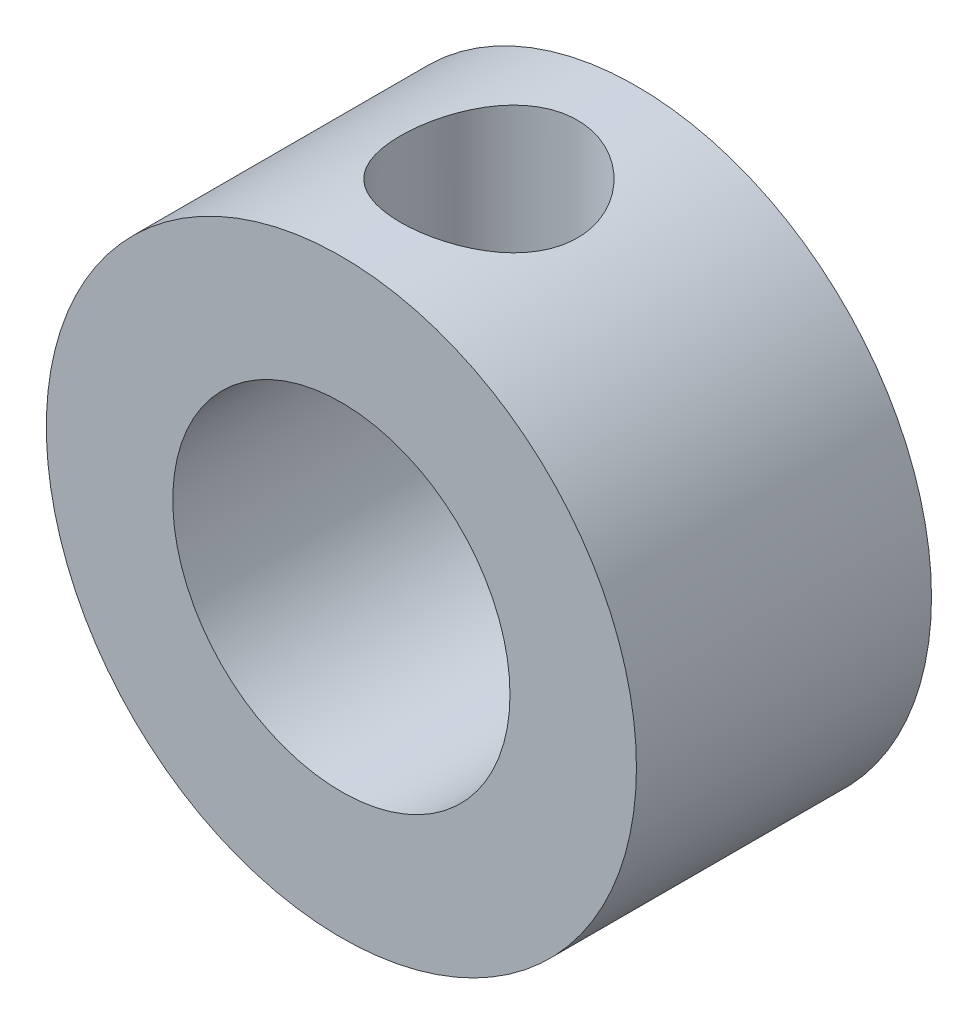
ISO-10303-21;
HEADER;
FILE_DESCRIPTION(('STEP AP214'),'2;1');
FILE_NAME('part.step','',(''),(''),'','','');
FILE_SCHEMA(('AUTOMOTIVE_DESIGN { 1 0 10303 214 1 1 1 1 }'));
ENDSEC;
DATA;
#1=APPLICATION_CONTEXT('core data for automotive mechanical design processes');
#2=APPLICATION_PROTOCOL_DEFINITION('international standard','automotive_design',2000,#1);
#3=PRODUCT_CONTEXT('',#1,'mechanical');
#4=PRODUCT('Part','Part','',(#3));
#5=PRODUCT_RELATED_PRODUCT_CATEGORY('part','',(#4));
#6=PRODUCT_DEFINITION_FORMATION('','',#4);
#7=PRODUCT_DEFINITION_CONTEXT('part definition',#1,'design');
#8=PRODUCT_DEFINITION('design','',#6,#7);
#9=PRODUCT_DEFINITION_SHAPE('','',#8);
#10=(LENGTH_UNIT() NAMED_UNIT(*) SI_UNIT(.MILLI.,.METRE.));
#11=(NAMED_UNIT(*) PLANE_ANGLE_UNIT() SI_UNIT($,.RADIAN.));
#12=(NAMED_UNIT(*) SI_UNIT($,.STERADIAN.) SOLID_ANGLE_UNIT());
#13=UNCERTAINTY_MEASURE_WITH_UNIT(LENGTH_MEASURE(1.E-05),#10,'distance_accuracy_value','');
#14=(GEOMETRIC_REPRESENTATION_CONTEXT(3) GLOBAL_UNCERTAINTY_ASSIGNED_CONTEXT((#13)) GLOBAL_UNIT_ASSIGNED_CONTEXT((#10,
#11,#12)) REPRESENTATION_CONTEXT('',''));
#15=CARTESIAN_POINT('',(0.,0.,0.));
#16=DIRECTION('',(0.,0.,1.));
#17=DIRECTION('',(1.,0.,0.));
#18=AXIS2_PLACEMENT_3D('',#15,#16,#17);
#19=CARTESIAN_POINT('',(0.,0.,7.));
#20=DIRECTION('',(0.,0.,1.));
#21=DIRECTION('',(1.,0.,0.));
#22=AXIS2_PLACEMENT_3D('',#19,#20,#21);
#23=PLANE('',#22);
#24=CARTESIAN_POINT('',(0.,0.,7.));
#25=DIRECTION('',(0.,0.,1.));
#26=DIRECTION('',(1.,0.,0.));
#27=AXIS2_PLACEMENT_3D('',#24,#25,#26);
#28=CIRCLE('',#27,7.);
#29=CARTESIAN_POINT('',(7.,0.,7.));
#30=VERTEX_POINT('',#29);
#31=EDGE_CURVE('E10',#30,#30,#28,.T.);
#32=ORIENTED_EDGE('',*,*,#31,.T.);
#33=EDGE_LOOP('',(#32));
#34=FACE_BOUND('',#33,.T.);
#35=CARTESIAN_POINT('',(0.,0.,7.));
#36=DIRECTION('',(0.,0.,1.));
#37=DIRECTION('',(1.,0.,0.));
#38=AXIS2_PLACEMENT_3D('',#35,#36,#37);
#39=CIRCLE('',#38,4.);
#40=CARTESIAN_POINT('',(4.,0.,7.));
#41=VERTEX_POINT('',#40);
#42=EDGE_CURVE('E47',#41,#41,#39,.T.);
#43=ORIENTED_EDGE('',*,*,#42,.F.);
#44=EDGE_LOOP('',(#43));
#45=FACE_BOUND('',#44,.T.);
#46=ADVANCED_FACE('F35',(#34,#45),#23,.T.);
#47=CARTESIAN_POINT('',(0.,0.,0.));
#48=DIRECTION('',(0.,0.,1.));
#49=DIRECTION('',(1.,0.,0.));
#50=AXIS2_PLACEMENT_3D('',#47,#48,#49);
#51=PLANE('',#50);
#52=CARTESIAN_POINT('',(0.,0.,0.));
#53=DIRECTION('',(0.,0.,1.));
#54=DIRECTION('',(1.,0.,0.));
#55=AXIS2_PLACEMENT_3D('',#52,#53,#54);
#56=CIRCLE('',#55,7.);
#57=CARTESIAN_POINT('',(7.,0.,0.));
#58=VERTEX_POINT('',#57);
#59=EDGE_CURVE('E40',#58,#58,#56,.T.);
#60=ORIENTED_EDGE('',*,*,#59,.F.);
#61=EDGE_LOOP('',(#60));
#62=FACE_BOUND('',#61,.T.);
#63=CARTESIAN_POINT('',(0.,0.,0.));
#64=DIRECTION('',(0.,0.,1.));
#65=DIRECTION('',(1.,0.,0.));
#66=AXIS2_PLACEMENT_3D('',#63,#64,#65);
#67=CIRCLE('',#66,4.);
#68=CARTESIAN_POINT('',(4.,0.,0.));
#69=VERTEX_POINT('',#68);
#70=EDGE_CURVE('E49',#69,#69,#67,.T.);
#71=ORIENTED_EDGE('',*,*,#70,.T.);
#72=EDGE_LOOP('',(#71));
#73=FACE_BOUND('',#72,.T.);
#74=ADVANCED_FACE('F76',(#62,#73),#51,.F.);
#75=CARTESIAN_POINT('',(0.,0.,7.));
#76=DIRECTION('',(0.,0.,-1.));
#77=DIRECTION('',(-1.,0.,0.));
#78=AXIS2_PLACEMENT_3D('',#75,#76,#77);
#79=CYLINDRICAL_SURFACE('',#78,7.);
#80=CARTESIAN_POINT('',(0.,7.,5.59999999999999));
#81=CARTESIAN_POINT('',(-0.115204057854619,6.9999990095077,5.59999860352115));
#82=CARTESIAN_POINT('',(-0.23042224569214,6.99712881971535,5.59048859092644));
#83=CARTESIAN_POINT('',(-0.457503375426832,6.98595947831167,5.55279010408905));
#84=CARTESIAN_POINT('',(-0.569365306175986,6.97765870745569,5.52459605876731));
#85=CARTESIAN_POINT('',(-0.786425790856335,6.95653773502571,5.45055557632562));
#86=CARTESIAN_POINT('',(-0.89163391015352,6.94372420350596,5.40473518253348));
#87=CARTESIAN_POINT('',(-1.09287385347438,6.91490952932704,5.29684946972182));
#88=CARTESIAN_POINT('',(-1.18890445445753,6.89890796268893,5.23478198964641));
#89=CARTESIAN_POINT('',(-1.37182051605724,6.86491032069884,5.09428638953826));
#90=CARTESIAN_POINT('',(-1.45840529974207,6.84687337119851,5.01547672375972));
#91=CARTESIAN_POINT('',(-1.61734889292653,6.81108167894619,4.84454707812574));
#92=CARTESIAN_POINT('',(-1.68970530858417,6.79332698414302,4.75242486302505));
#93=CARTESIAN_POINT('',(-1.8197205281319,6.75967759591281,4.55494094574734));
#94=CARTESIAN_POINT('',(-1.87701232631098,6.74383369329425,4.44932815461296));
#95=CARTESIAN_POINT('',(-1.97289952684664,6.71641068551644,4.22941504407759));
#96=CARTESIAN_POINT('',(-2.01149941887962,6.70483055638635,4.11511681850083));
#97=CARTESIAN_POINT('',(-2.06782287155712,6.68767219173808,3.88445362741736));
#98=CARTESIAN_POINT('',(-2.08610074728548,6.68193497054347,3.76823615859048));
#99=CARTESIAN_POINT('',(-2.1029922286054,6.67663905649674,3.53425358129653));
#100=CARTESIAN_POINT('',(-2.10161059865509,6.677078866648,3.41648885471728));
#101=CARTESIAN_POINT('',(-2.07965768079736,6.68394641694889,3.18726252794812));
#102=CARTESIAN_POINT('',(-2.05978087367759,6.69015744038797,3.07572684949287));
#103=CARTESIAN_POINT('',(-2.00252388597878,6.70751698720074,2.85765229921716));
#104=CARTESIAN_POINT('',(-1.96514197798297,6.71866599785291,2.75111392167594));
#105=CARTESIAN_POINT('',(-1.87342437315154,6.74481826304963,2.54435951047497));
#106=CARTESIAN_POINT('',(-1.81886343708499,6.75987222562333,2.44425008246264));
#107=CARTESIAN_POINT('',(-1.69449311624156,6.7921138180009,2.25437516918573));
#108=CARTESIAN_POINT('',(-1.62468003603623,6.80930196445788,2.16461219882071));
#109=CARTESIAN_POINT('',(-1.46833807071764,6.84475415817112,1.99403933293317));
#110=CARTESIAN_POINT('',(-1.38123287045376,6.86303316034697,1.91375987035847));
#111=CARTESIAN_POINT('',(-1.19456856303955,6.89797141688562,1.76882442231006));
#112=CARTESIAN_POINT('',(-1.09500867260524,6.91463056925774,1.70416942021981));
#113=CARTESIAN_POINT('',(-0.885297053679921,6.94460424097259,1.59199610854938));
#114=CARTESIAN_POINT('',(-0.775078849647127,6.9578956113564,1.5445954772502));
#115=CARTESIAN_POINT('',(-0.547743581844925,6.97946930565111,1.46916057386052));
#116=CARTESIAN_POINT('',(-0.430628452225412,6.98775302661799,1.44112090005452));
#117=CARTESIAN_POINT('',(-0.197333139735663,6.99815710500954,1.40608695094086));
#118=CARTESIAN_POINT('',(-0.0812701366416606,7.00048790584906,1.39837377987775));
#119=CARTESIAN_POINT('',(0.150499448152737,6.99934092538464,1.40219681799692));
#120=CARTESIAN_POINT('',(0.266206075367093,6.9958639194886,1.41373045751203));
#121=CARTESIAN_POINT('',(0.491265047433575,6.98362975782027,1.4551384555561));
#122=CARTESIAN_POINT('',(0.600701881659836,6.9749936171918,1.48459274261322));
#123=CARTESIAN_POINT('',(0.813056494536329,6.95344086978149,1.56050052588949));
#124=CARTESIAN_POINT('',(0.915973487835815,6.94052374849531,1.60695606545301));
#125=CARTESIAN_POINT('',(1.11501206524547,6.91137516091842,1.71675443167359));
#126=CARTESIAN_POINT('',(1.21092135667953,6.89507393161496,1.78046307732718));
#127=CARTESIAN_POINT('',(1.3909326311722,6.86102856270093,1.92251465567393));
#128=CARTESIAN_POINT('',(1.47503164529831,6.84328406203694,2.00086125664271));
#129=CARTESIAN_POINT('',(1.63220042371436,6.80754440616605,2.17334223171712));
#130=CARTESIAN_POINT('',(1.704758737241,6.78956355045859,2.26794662608056));
#131=CARTESIAN_POINT('',(1.83300593101018,6.75607121334564,2.46837911461882));
#132=CARTESIAN_POINT('',(1.88869525361275,6.74055966719185,2.57420691438104));
#133=CARTESIAN_POINT('',(1.9812428597802,6.71394065458417,2.79374548775703));
#134=CARTESIAN_POINT('',(2.01818885711814,6.70281272971451,2.90741666115297));
#135=CARTESIAN_POINT('',(2.07230423141214,6.68628232117816,3.13976315650233));
#136=CARTESIAN_POINT('',(2.08948038570493,6.68087787548571,3.25843674909625));
#137=CARTESIAN_POINT('',(2.1031077827895,6.67659961459091,3.49210612574379));
#138=CARTESIAN_POINT('',(2.1003927743112,6.67746306290276,3.60704911146919));
#139=CARTESIAN_POINT('',(2.07630507622027,6.68499161674532,3.83475974476086));
#140=CARTESIAN_POINT('',(2.05493313374585,6.69165648995131,3.94752747925272));
#141=CARTESIAN_POINT('',(1.9946764432608,6.7098606917247,4.16632355878434));
#142=CARTESIAN_POINT('',(1.95601245709973,6.72133846373454,4.27241820230217));
#143=CARTESIAN_POINT('',(1.86244109969503,6.74786390463686,4.47669941434901));
#144=CARTESIAN_POINT('',(1.80753061948005,6.76291225669556,4.5748844646982));
#145=CARTESIAN_POINT('',(1.68068269327122,6.79556746998737,4.76442836313677));
#146=CARTESIAN_POINT('',(1.60819786530197,6.81324756230006,4.85540826576426));
#147=CARTESIAN_POINT('',(1.44924408481688,6.84881848629347,5.02418349763132));
#148=CARTESIAN_POINT('',(1.36277150398828,6.8667093715328,5.10197539525494));
#149=CARTESIAN_POINT('',(1.17525206705656,6.90131311199101,5.24443277721295));
#150=CARTESIAN_POINT('',(1.07385304010685,6.91797623671995,5.30864802559766));
#151=CARTESIAN_POINT('',(0.861197923576932,6.94764952638087,5.41902923786565));
#152=CARTESIAN_POINT('',(0.749946474198531,6.9606613990348,5.46520364358431));
#153=CARTESIAN_POINT('',(0.533060797717391,6.98043044957033,5.53405338591384));
#154=CARTESIAN_POINT('',(0.428101746735925,6.98770838333498,5.55871634203654));
#155=CARTESIAN_POINT('',(0.215432273323089,6.99749322292286,5.5916889353382));
#156=CARTESIAN_POINT('',(0.107722313801395,7.00000092616635,5.60000130578674));
#157=CARTESIAN_POINT('',(0.,7.,5.59999999999999));
#158=B_SPLINE_CURVE_WITH_KNOTS('',3,(#80,#81,#82,#83,#84,#85,#86,#87,#88,#89,#90,#91,#92,#93,
#94,#95,#96,#97,#98,#99,#100,#101,#102,#103,#104,#105,#106,#107,#108,#109,#110,#111,#112,#113,
#114,#115,#116,#117,#118,#119,#120,#121,#122,#123,#124,#125,#126,#127,#128,#129,#130,#131,#132,
#133,#134,#135,#136,#137,#138,#139,#140,#141,#142,#143,#144,#145,#146,#147,#148,#149,#150,#151,
#152,#153,#154,#155,#156,#157),.UNSPECIFIED.,.T.,.F.,(4,2,2,2,2,2,2,2,2,2,2,2,2,2,2,2,2,2,2,2,2,
2,2,2,2,2,2,2,2,2,2,2,2,2,2,2,2,2,4),(0.,0.345216485057654,0.690535950784397,1.03534714682122,
1.38020423017778,1.73397844127468,2.08781212204086,2.44960073405752,2.81130240360512,
3.16287565099237,3.51436369646724,3.85316423376745,4.191998211212,4.53547397025966,
4.87903304221976,5.23693945667431,5.59486839143498,5.95519465634362,6.31542034940329,
6.66272333213961,7.00997994970455,7.34939445355255,7.68884976431217,8.03615827984069,
8.38355394800265,8.74356560451943,9.1035678195375,9.46186940931749,9.82004813244393,
10.1633021765698,10.5065424753262,10.8455205657019,11.1845635658073,11.5359569595828,
11.8874416486288,12.2492019462572,12.6107927623971,12.9336436870902,13.256440637348),.UNSPECIFIED.);
#159=CARTESIAN_POINT('',(0.,7.,5.59999999999999));
#160=VERTEX_POINT('',#159);
#161=EDGE_CURVE('E52',#160,#160,#158,.T.);
#162=ORIENTED_EDGE('',*,*,#161,.T.);
#163=EDGE_LOOP('',(#162));
#164=FACE_BOUND('',#163,.T.);
#165=ORIENTED_EDGE('',*,*,#31,.F.);
#166=EDGE_LOOP('',(#165));
#167=FACE_BOUND('',#166,.T.);
#168=ORIENTED_EDGE('',*,*,#59,.T.);
#169=EDGE_LOOP('',(#168));
#170=FACE_BOUND('',#169,.T.);
#171=ADVANCED_FACE('F37',(#164,#167,#170),#79,.T.);
#172=CARTESIAN_POINT('',(0.,0.,7.));
#173=DIRECTION('',(0.,0.,-1.));
#174=DIRECTION('',(-1.,0.,0.));
#175=AXIS2_PLACEMENT_3D('',#172,#173,#174);
#176=CYLINDRICAL_SURFACE('',#175,4.);
#177=CARTESIAN_POINT('',(0.,4.,5.59999999999999));
#178=CARTESIAN_POINT('',(-0.109725239522176,3.99999264287857,5.59999149182402));
#179=CARTESIAN_POINT('',(-0.219566121797986,3.99543735627817,5.59134922217853));
#180=CARTESIAN_POINT('',(-0.435956332853302,3.97766056559727,5.55717948516371));
#181=CARTESIAN_POINT('',(-0.542499967026169,3.96442485872988,5.53162434455592));
#182=CARTESIAN_POINT('',(-0.748847767256636,3.93066356262107,5.46492682041998));
#183=CARTESIAN_POINT('',(-0.848677088492019,3.91016722161181,5.42384693196482));
#184=CARTESIAN_POINT('',(-1.0398542926017,3.86372814833453,5.32761268027));
#185=CARTESIAN_POINT('',(-1.13120230734359,3.83778550076629,5.27245853590725));
#186=CARTESIAN_POINT('',(-1.30947182891695,3.78081963010103,5.14560480379001));
#187=CARTESIAN_POINT('',(-1.39572427915895,3.7495762633363,5.07306544943579));
#188=CARTESIAN_POINT('',(-1.55546505007128,3.68618069665244,4.91532568390628));
#189=CARTESIAN_POINT('',(-1.62894256542358,3.65402775386038,4.83011466668523));
#190=CARTESIAN_POINT('',(-1.76753210720386,3.58917602274785,4.64052416418153));
#191=CARTESIAN_POINT('',(-1.83134596949795,3.55667651133239,4.53511911137416));
#192=CARTESIAN_POINT('',(-1.940078009522,3.49855992208216,4.31322101259495));
#193=CARTESIAN_POINT('',(-1.98501055983617,3.47293761465966,4.19673648353417));
#194=CARTESIAN_POINT('',(-2.05162778973322,3.43398312295477,3.9632691019904));
#195=CARTESIAN_POINT('',(-2.07458133375183,3.41998733122417,3.84676509569801));
#196=CARTESIAN_POINT('',(-2.10042065774089,3.40418721984817,3.61079196134464));
#197=CARTESIAN_POINT('',(-2.10333025607271,3.40236843025802,3.49132652193647));
#198=CARTESIAN_POINT('',(-2.08992575686747,3.41060563138389,3.27023585900601));
#199=CARTESIAN_POINT('',(-2.07615752002025,3.4190893964975,3.16838235315366));
#200=CARTESIAN_POINT('',(-2.03424482005422,3.44418916575293,2.96871985136041));
#201=CARTESIAN_POINT('',(-2.00609491145431,3.46080825015501,2.87091240259461));
#202=CARTESIAN_POINT('',(-1.93576201725034,3.50064017337879,2.67933944133553));
#203=CARTESIAN_POINT('',(-1.89327386515966,3.52399463994301,2.58571682638858));
#204=CARTESIAN_POINT('',(-1.79571666755297,3.57469177714186,2.40646125445991));
#205=CARTESIAN_POINT('',(-1.74064200304352,3.60203622704668,2.32083189002303));
#206=CARTESIAN_POINT('',(-1.61039398180521,3.66230444404028,2.14721957759017));
#207=CARTESIAN_POINT('',(-1.53347842501707,3.69546972830905,2.0606227305343));
#208=CARTESIAN_POINT('',(-1.36616462781175,3.76053926987168,1.90094507949335));
#209=CARTESIAN_POINT('',(-1.27575868558247,3.79244279356364,1.82787205014572));
#210=CARTESIAN_POINT('',(-1.07766804032998,3.85356353260701,1.69341787931535));
#211=CARTESIAN_POINT('',(-0.969298919443496,3.88252998474475,1.63292153118831));
#212=CARTESIAN_POINT('',(-0.742023442184859,3.93228772595726,1.53153732928501));
#213=CARTESIAN_POINT('',(-0.623126340783865,3.95308610970455,1.4906324518135));
#214=CARTESIAN_POINT('',(-0.389396974626688,3.9825873442618,1.43322732089386));
#215=CARTESIAN_POINT('',(-0.275130823094222,3.99219507728301,1.4148930907168));
#216=CARTESIAN_POINT('',(-0.0447608666750918,4.00140669767392,1.39730685099086));
#217=CARTESIAN_POINT('',(0.0713418920739022,4.00101608864393,1.39804434338993));
#218=CARTESIAN_POINT('',(0.291279078552977,3.99076728683619,1.41762725788288));
#219=CARTESIAN_POINT('',(0.395299675486035,3.98173859499713,1.43488622954968));
#220=CARTESIAN_POINT('',(0.59872818219623,3.95626547527309,1.4844387504391));
#221=CARTESIAN_POINT('',(0.69813560404272,3.93982026491349,1.51673388605335));
#222=CARTESIAN_POINT('',(0.892553327327724,3.90044221082327,1.59614425381874));
#223=CARTESIAN_POINT('',(0.987382033379108,3.87735176388228,1.64362307426732));
#224=CARTESIAN_POINT('',(1.16801156602731,3.82682103032807,1.75161917503483));
#225=CARTESIAN_POINT('',(1.25380875133066,3.79937900035166,1.81214168451701));
#226=CARTESIAN_POINT('',(1.42355402164766,3.73930849945052,1.95183455389138));
#227=CARTESIAN_POINT('',(1.50635375236175,3.70643824529688,2.03229813881506));
#228=CARTESIAN_POINT('',(1.65784945462857,3.64120206418591,2.20585137885724));
#229=CARTESIAN_POINT('',(1.72653319455466,3.60883659688132,2.298951868959));
#230=CARTESIAN_POINT('',(1.85197407713202,3.54618291275876,2.50233559015912));
#231=CARTESIAN_POINT('',(1.907720584217,3.51615003477916,2.61332823562711));
#232=CARTESIAN_POINT('',(1.99916377433975,3.46498558301669,2.84516122596434));
#233=CARTESIAN_POINT('',(2.03488847416354,3.44384158132139,2.96598753776114));
#234=CARTESIAN_POINT('',(2.08179228794019,3.41567335738197,3.20149049526115));
#235=CARTESIAN_POINT('',(2.09503212797938,3.4074693970288,3.31561103123257));
#236=CARTESIAN_POINT('',(2.10264402498694,3.40278132518373,3.54469308443814));
#237=CARTESIAN_POINT('',(2.09702755352025,3.40629008804561,3.6596540479175));
#238=CARTESIAN_POINT('',(2.06905731966412,3.42333280060867,3.87316961432223));
#239=CARTESIAN_POINT('',(2.04869586578453,3.4356715106149,3.97209433551285));
#240=CARTESIAN_POINT('',(1.99445953447468,3.4674360798436,4.16496081401225));
#241=CARTESIAN_POINT('',(1.96057985676336,3.48686445637592,4.25890078781238));
#242=CARTESIAN_POINT('',(1.8778270800915,3.53215539501753,4.44599660125697));
#243=CARTESIAN_POINT('',(1.82811697206111,3.55835615136984,4.53869769157733));
#244=CARTESIAN_POINT('',(1.71597189148521,3.61377283019222,4.71506230921822));
#245=CARTESIAN_POINT('',(1.65353007488422,3.64299037017672,4.79872093850826));
#246=CARTESIAN_POINT('',(1.50756499361577,3.7059946066124,4.96672364713411));
#247=CARTESIAN_POINT('',(1.42231898680451,3.73985298438168,5.04955350976633));
#248=CARTESIAN_POINT('',(1.2383912708079,3.80472261290781,5.20015739194561));
#249=CARTESIAN_POINT('',(1.13970134446325,3.83573210281286,5.26792213623382));
#250=CARTESIAN_POINT('',(0.928722586410789,3.89224463430732,5.38743364904117));
#251=CARTESIAN_POINT('',(0.816206474636302,3.91762876470986,5.43884301060635));
#252=CARTESIAN_POINT('',(0.641101799511677,3.94873745727715,5.50070791315573));
#253=CARTESIAN_POINT('',(0.581718321049471,3.95794212176884,5.51878135698884));
#254=CARTESIAN_POINT('',(0.461272845180562,3.97377707651405,5.54965439112677));
#255=CARTESIAN_POINT('',(0.400211824286285,3.98040883184999,5.56245698304871));
#256=CARTESIAN_POINT('',(0.282777177199966,3.99038534961525,5.58164251076547));
#257=CARTESIAN_POINT('',(0.226504746010371,3.99398117175069,5.58851710911177));
#258=CARTESIAN_POINT('',(0.113498532604898,3.99879042332403,5.59769809925702));
#259=CARTESIAN_POINT('',(0.0567647413745303,4.00000380609873,5.60000440157989));
#260=CARTESIAN_POINT('',(0.,4.,5.59999999999999));
#261=B_SPLINE_CURVE_WITH_KNOTS('',3,(#177,#178,#179,#180,#181,#182,#183,#184,#185,#186,#187,
#188,#189,#190,#191,#192,#193,#194,#195,#196,#197,#198,#199,#200,#201,#202,#203,#204,#205,#206,
#207,#208,#209,#210,#211,#212,#213,#214,#215,#216,#217,#218,#219,#220,#221,#222,#223,#224,#225,
#226,#227,#228,#229,#230,#231,#232,#233,#234,#235,#236,#237,#238,#239,#240,#241,#242,#243,#244,
#245,#246,#247,#248,#249,#250,#251,#252,#253,#254,#255,#256,#257,#258,#259,#260),.UNSPECIFIED.,
.T.,.F.,(4,2,2,2,2,2,2,2,2,2,2,2,2,2,2,2,2,2,2,2,2,2,2,2,2,2,2,2,2,2,2,2,2,2,2,2,2,2,2,2,2,4),
(0.,0.328955388056857,0.658450355809532,0.986632826787795,1.31481019432104,1.66422610127769,
2.01393612903032,2.3943054227538,2.77438464995627,3.13089429519634,3.48698022433371,
3.79492330354658,4.1029830689429,4.41806287071791,4.73328360921355,5.09317488258759,
5.45327241364169,5.83355153918035,6.21349962504737,6.55994297045683,6.90619561978192,
7.2222202700175,7.53827827001647,7.8625561182731,8.18696421086292,8.54557019619713,
8.90448561862084,9.28577946390599,9.66653841880975,10.0100186118085,10.3532898805347,
10.6572136356427,10.9612454093543,11.2851996834104,11.6093285635883,11.9784125341219,
12.347723115996,12.7242211787441,12.9122308814786,13.1001333688401,13.2703102751049,
13.4404905144748),.UNSPECIFIED.);
#262=CARTESIAN_POINT('',(0.,4.,5.59999999999999));
#263=VERTEX_POINT('',#262);
#264=EDGE_CURVE('E60',#263,#263,#261,.T.);
#265=ORIENTED_EDGE('',*,*,#264,.F.);
#266=EDGE_LOOP('',(#265));
#267=FACE_BOUND('',#266,.T.);
#268=ORIENTED_EDGE('',*,*,#42,.T.);
#269=EDGE_LOOP('',(#268));
#270=FACE_BOUND('',#269,.T.);
#271=ORIENTED_EDGE('',*,*,#70,.F.);
#272=EDGE_LOOP('',(#271));
#273=FACE_BOUND('',#272,.T.);
#274=ADVANCED_FACE('F67',(#267,#270,#273),#176,.F.);
#275=CARTESIAN_POINT('',(0.,7.,3.5));
#276=DIRECTION('',(0.,1.,0.));
#277=DIRECTION('',(0.,0.,1.));
#278=AXIS2_PLACEMENT_3D('',#275,#276,#277);
#279=CYLINDRICAL_SURFACE('',#278,2.09999999999999);
#280=ORIENTED_EDGE('',*,*,#264,.T.);
#281=EDGE_LOOP('',(#280));
#282=FACE_BOUND('',#281,.T.);
#283=ORIENTED_EDGE('',*,*,#161,.F.);
#284=EDGE_LOOP('',(#283));
#285=FACE_BOUND('',#284,.T.);
#286=ADVANCED_FACE('F64',(#282,#285),#279,.F.);
#287=CLOSED_SHELL('',(#46,#74,#171,#274,#286));
#288=MANIFOLD_SOLID_BREP('B2',#287);
#289=ADVANCED_BREP_SHAPE_REPRESENTATION('',(#18,#288),#14);
#290=SHAPE_DEFINITION_REPRESENTATION(#9,#289);
ENDSEC;
END-ISO-10303-21;
